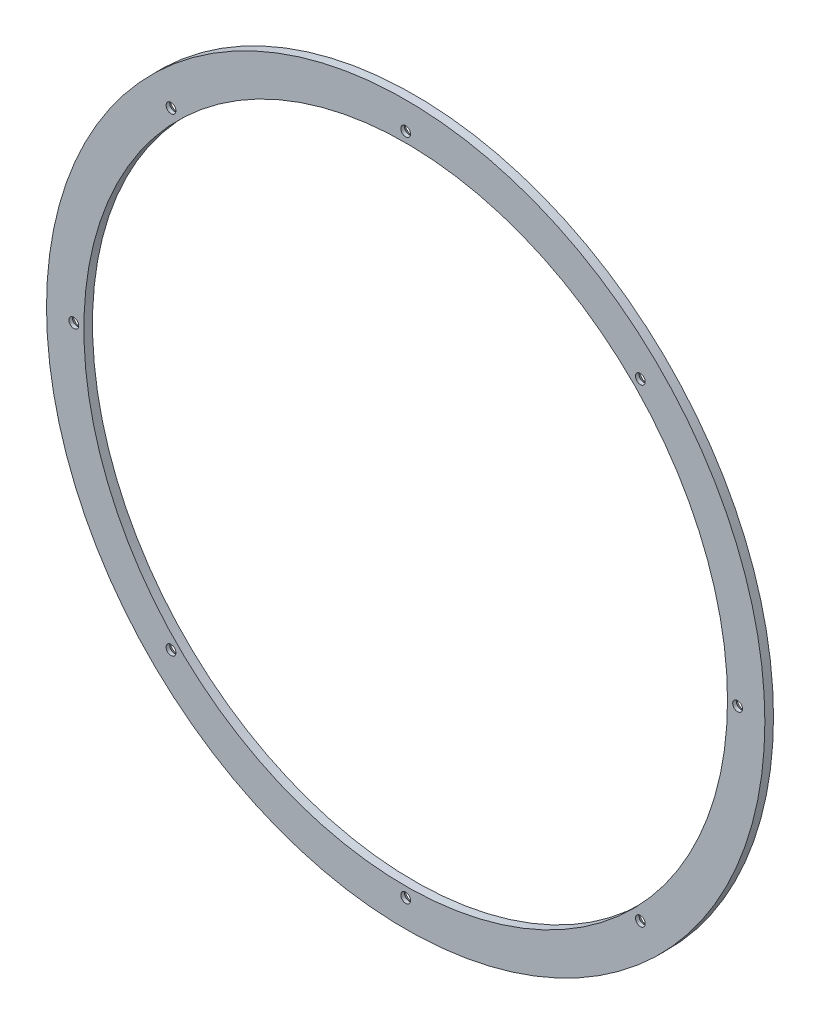
ISO-10303-21;
HEADER;
FILE_DESCRIPTION(('STEP AP214'),'2;1');
FILE_NAME('part.step','',(''),(''),'','','');
FILE_SCHEMA(('AUTOMOTIVE_DESIGN { 1 0 10303 214 1 1 1 1 }'));
ENDSEC;
DATA;
#1=APPLICATION_CONTEXT('core data for automotive mechanical design processes');
#2=APPLICATION_PROTOCOL_DEFINITION('international standard','automotive_design',2000,#1);
#3=PRODUCT_CONTEXT('',#1,'mechanical');
#4=PRODUCT('Part','Part','',(#3));
#5=PRODUCT_RELATED_PRODUCT_CATEGORY('part','',(#4));
#6=PRODUCT_DEFINITION_FORMATION('','',#4);
#7=PRODUCT_DEFINITION_CONTEXT('part definition',#1,'design');
#8=PRODUCT_DEFINITION('design','',#6,#7);
#9=PRODUCT_DEFINITION_SHAPE('','',#8);
#10=(LENGTH_UNIT() NAMED_UNIT(*) SI_UNIT(.MILLI.,.METRE.));
#11=(NAMED_UNIT(*) PLANE_ANGLE_UNIT() SI_UNIT($,.RADIAN.));
#12=(NAMED_UNIT(*) SI_UNIT($,.STERADIAN.) SOLID_ANGLE_UNIT());
#13=UNCERTAINTY_MEASURE_WITH_UNIT(LENGTH_MEASURE(1.E-05),#10,'distance_accuracy_value','');
#14=(GEOMETRIC_REPRESENTATION_CONTEXT(3) GLOBAL_UNCERTAINTY_ASSIGNED_CONTEXT((#13)) GLOBAL_UNIT_ASSIGNED_CONTEXT((#10,
#11,#12)) REPRESENTATION_CONTEXT('',''));
#15=CARTESIAN_POINT('',(0.,0.,0.));
#16=DIRECTION('',(0.,0.,1.));
#17=DIRECTION('',(1.,0.,0.));
#18=AXIS2_PLACEMENT_3D('',#15,#16,#17);
#19=CARTESIAN_POINT('',(0.,0.,3.));
#20=DIRECTION('',(0.,0.,1.));
#21=DIRECTION('',(1.,0.,0.));
#22=AXIS2_PLACEMENT_3D('',#19,#20,#21);
#23=PLANE('',#22);
#24=CARTESIAN_POINT('',(3.8091813037436E-13,-115.5,3.));
#25=DIRECTION('',(0.,0.,-1.));
#26=DIRECTION('',(0.,-1.,0.));
#27=AXIS2_PLACEMENT_3D('',#24,#25,#26);
#28=CIRCLE('',#27,1.69999999999999);
#29=CARTESIAN_POINT('',(3.86863374671228E-13,-117.2,3.));
#30=VERTEX_POINT('',#29);
#31=EDGE_CURVE('E116',#30,#30,#28,.T.);
#32=ORIENTED_EDGE('',*,*,#31,.T.);
#33=EDGE_LOOP('',(#32));
#34=FACE_BOUND('',#33,.T.);
#35=CARTESIAN_POINT('',(81.6708332270467,-81.6708332270458,3.));
#36=DIRECTION('',(0.,0.,-1.));
#37=DIRECTION('',(0.707106781186551,-0.707106781186544,0.));
#38=AXIS2_PLACEMENT_3D('',#35,#36,#37);
#39=CIRCLE('',#38,1.69999999999999);
#40=CARTESIAN_POINT('',(82.8729147550638,-82.8729147550629,3.));
#41=VERTEX_POINT('',#40);
#42=EDGE_CURVE('E109',#41,#41,#39,.T.);
#43=ORIENTED_EDGE('',*,*,#42,.T.);
#44=EDGE_LOOP('',(#43));
#45=FACE_BOUND('',#44,.T.);
#46=CARTESIAN_POINT('',(115.5,0.,3.));
#47=DIRECTION('',(0.,0.,-1.));
#48=DIRECTION('',(1.,0.,0.));
#49=AXIS2_PLACEMENT_3D('',#46,#47,#48);
#50=CIRCLE('',#49,1.69999999999999);
#51=CARTESIAN_POINT('',(117.2,0.,3.));
#52=VERTEX_POINT('',#51);
#53=EDGE_CURVE('E100',#52,#52,#50,.T.);
#54=ORIENTED_EDGE('',*,*,#53,.T.);
#55=EDGE_LOOP('',(#54));
#56=FACE_BOUND('',#55,.T.);
#57=CARTESIAN_POINT('',(81.6708332270455,81.6708332270469,3.));
#58=DIRECTION('',(0.,0.,-1.));
#59=DIRECTION('',(0.707106781186541,0.707106781186554,0.));
#60=AXIS2_PLACEMENT_3D('',#57,#58,#59);
#61=CIRCLE('',#60,1.69999999999999);
#62=CARTESIAN_POINT('',(82.8729147550626,82.8729147550641,3.));
#63=VERTEX_POINT('',#62);
#64=EDGE_CURVE('E87',#63,#63,#61,.T.);
#65=ORIENTED_EDGE('',*,*,#64,.T.);
#66=EDGE_LOOP('',(#65));
#67=FACE_BOUND('',#66,.T.);
#68=CARTESIAN_POINT('',(-1.22890525533212E-12,115.5,3.));
#69=DIRECTION('',(0.,0.,-1.));
#70=DIRECTION('',(0.,1.,0.));
#71=AXIS2_PLACEMENT_3D('',#68,#69,#70);
#72=CIRCLE('',#71,1.69999999999999);
#73=CARTESIAN_POINT('',(-1.24674098822272E-12,117.2,3.));
#74=VERTEX_POINT('',#73);
#75=EDGE_CURVE('E133',#74,#74,#72,.T.);
#76=ORIENTED_EDGE('',*,*,#75,.T.);
#77=EDGE_LOOP('',(#76));
#78=FACE_BOUND('',#77,.T.);
#79=CARTESIAN_POINT('',(-81.6708332270473,81.6708332270452,3.));
#80=DIRECTION('',(0.,0.,-1.));
#81=DIRECTION('',(-0.707106781186556,0.707106781186539,0.));
#82=AXIS2_PLACEMENT_3D('',#79,#80,#81);
#83=CIRCLE('',#82,1.69999999999999);
#84=CARTESIAN_POINT('',(-82.8729147550644,82.8729147550623,3.));
#85=VERTEX_POINT('',#84);
#86=EDGE_CURVE('E125',#85,#85,#83,.T.);
#87=ORIENTED_EDGE('',*,*,#86,.T.);
#88=EDGE_LOOP('',(#87));
#89=FACE_BOUND('',#88,.T.);
#90=CARTESIAN_POINT('',(-81.6708332270461,-81.6708332270464,3.));
#91=DIRECTION('',(0.,0.,-1.));
#92=DIRECTION('',(-0.707106781186546,-0.707106781186549,0.));
#93=AXIS2_PLACEMENT_3D('',#90,#91,#92);
#94=CIRCLE('',#93,1.69999999999999);
#95=CARTESIAN_POINT('',(-82.8729147550632,-82.8729147550635,3.));
#96=VERTEX_POINT('',#95);
#97=EDGE_CURVE('E75',#96,#96,#94,.T.);
#98=ORIENTED_EDGE('',*,*,#97,.T.);
#99=EDGE_LOOP('',(#98));
#100=FACE_BOUND('',#99,.T.);
#101=CARTESIAN_POINT('',(-115.5,0.,3.));
#102=DIRECTION('',(0.,0.,-1.));
#103=DIRECTION('',(-1.,0.,0.));
#104=AXIS2_PLACEMENT_3D('',#101,#102,#103);
#105=CIRCLE('',#104,1.69999999999999);
#106=CARTESIAN_POINT('',(-117.2,0.,3.));
#107=VERTEX_POINT('',#106);
#108=EDGE_CURVE('E57',#107,#107,#105,.T.);
#109=ORIENTED_EDGE('',*,*,#108,.T.);
#110=EDGE_LOOP('',(#109));
#111=FACE_BOUND('',#110,.T.);
#112=CARTESIAN_POINT('',(0.,0.,3.));
#113=DIRECTION('',(0.,0.,1.));
#114=DIRECTION('',(1.,0.,0.));
#115=AXIS2_PLACEMENT_3D('',#112,#113,#114);
#116=CIRCLE('',#115,125.);
#117=CARTESIAN_POINT('',(125.,0.,3.));
#118=VERTEX_POINT('',#117);
#119=EDGE_CURVE('E10',#118,#118,#116,.T.);
#120=ORIENTED_EDGE('',*,*,#119,.T.);
#121=EDGE_LOOP('',(#120));
#122=FACE_BOUND('',#121,.T.);
#123=CARTESIAN_POINT('',(0.,0.,3.));
#124=DIRECTION('',(0.,0.,1.));
#125=DIRECTION('',(1.,0.,0.));
#126=AXIS2_PLACEMENT_3D('',#123,#124,#125);
#127=CIRCLE('',#126,112.);
#128=CARTESIAN_POINT('',(112.,0.,3.));
#129=VERTEX_POINT('',#128);
#130=EDGE_CURVE('E52',#129,#129,#127,.T.);
#131=ORIENTED_EDGE('',*,*,#130,.F.);
#132=EDGE_LOOP('',(#131));
#133=FACE_BOUND('',#132,.T.);
#134=ADVANCED_FACE('F38',(#34,#45,#56,#67,#78,#89,#100,#111,#122,#133),#23,.T.);
#135=CARTESIAN_POINT('',(0.,0.,0.));
#136=DIRECTION('',(0.,0.,1.));
#137=DIRECTION('',(1.,0.,0.));
#138=AXIS2_PLACEMENT_3D('',#135,#136,#137);
#139=PLANE('',#138);
#140=CARTESIAN_POINT('',(3.8091813037436E-13,-115.5,0.));
#141=DIRECTION('',(0.,0.,-1.));
#142=DIRECTION('',(0.,-1.,0.));
#143=AXIS2_PLACEMENT_3D('',#140,#141,#142);
#144=CIRCLE('',#143,3.44999999999999);
#145=CARTESIAN_POINT('',(3.92983479094474E-13,-118.95,0.));
#146=VERTEX_POINT('',#145);
#147=EDGE_CURVE('E108',#146,#146,#144,.T.);
#148=ORIENTED_EDGE('',*,*,#147,.F.);
#149=EDGE_LOOP('',(#148));
#150=FACE_BOUND('',#149,.T.);
#151=CARTESIAN_POINT('',(81.6708332270467,-81.6708332270458,0.));
#152=DIRECTION('',(0.,0.,-1.));
#153=DIRECTION('',(0.707106781186551,-0.707106781186544,0.));
#154=AXIS2_PLACEMENT_3D('',#151,#152,#153);
#155=CIRCLE('',#154,3.44999999999999);
#156=CARTESIAN_POINT('',(84.1103516221403,-84.1103516221394,0.));
#157=VERTEX_POINT('',#156);
#158=EDGE_CURVE('E99',#157,#157,#155,.T.);
#159=ORIENTED_EDGE('',*,*,#158,.F.);
#160=EDGE_LOOP('',(#159));
#161=FACE_BOUND('',#160,.T.);
#162=CARTESIAN_POINT('',(115.5,0.,0.));
#163=DIRECTION('',(0.,0.,-1.));
#164=DIRECTION('',(1.,0.,0.));
#165=AXIS2_PLACEMENT_3D('',#162,#163,#164);
#166=CIRCLE('',#165,3.44999999999999);
#167=CARTESIAN_POINT('',(118.95,0.,0.));
#168=VERTEX_POINT('',#167);
#169=EDGE_CURVE('E86',#168,#168,#166,.T.);
#170=ORIENTED_EDGE('',*,*,#169,.F.);
#171=EDGE_LOOP('',(#170));
#172=FACE_BOUND('',#171,.T.);
#173=CARTESIAN_POINT('',(81.6708332270455,81.6708332270469,0.));
#174=DIRECTION('',(0.,0.,-1.));
#175=DIRECTION('',(0.707106781186541,0.707106781186554,0.));
#176=AXIS2_PLACEMENT_3D('',#173,#174,#175);
#177=CIRCLE('',#176,3.44999999999999);
#178=CARTESIAN_POINT('',(84.1103516221391,84.1103516221405,0.));
#179=VERTEX_POINT('',#178);
#180=EDGE_CURVE('E91',#179,#179,#177,.T.);
#181=ORIENTED_EDGE('',*,*,#180,.F.);
#182=EDGE_LOOP('',(#181));
#183=FACE_BOUND('',#182,.T.);
#184=CARTESIAN_POINT('',(-1.22890525533212E-12,115.5,0.));
#185=DIRECTION('',(0.,0.,-1.));
#186=DIRECTION('',(0.,1.,0.));
#187=AXIS2_PLACEMENT_3D('',#184,#185,#186);
#188=CIRCLE('',#187,3.44999999999999);
#189=CARTESIAN_POINT('',(-1.26510130149246E-12,118.95,0.));
#190=VERTEX_POINT('',#189);
#191=EDGE_CURVE('E124',#190,#190,#188,.T.);
#192=ORIENTED_EDGE('',*,*,#191,.F.);
#193=EDGE_LOOP('',(#192));
#194=FACE_BOUND('',#193,.T.);
#195=CARTESIAN_POINT('',(-81.6708332270473,81.6708332270452,0.));
#196=DIRECTION('',(0.,0.,-1.));
#197=DIRECTION('',(-0.707106781186556,0.707106781186539,0.));
#198=AXIS2_PLACEMENT_3D('',#195,#196,#197);
#199=CIRCLE('',#198,3.44999999999999);
#200=CARTESIAN_POINT('',(-84.1103516221409,84.1103516221388,0.));
#201=VERTEX_POINT('',#200);
#202=EDGE_CURVE('E128',#201,#201,#199,.T.);
#203=ORIENTED_EDGE('',*,*,#202,.F.);
#204=EDGE_LOOP('',(#203));
#205=FACE_BOUND('',#204,.T.);
#206=CARTESIAN_POINT('',(-81.6708332270461,-81.6708332270464,0.));
#207=DIRECTION('',(0.,0.,-1.));
#208=DIRECTION('',(-0.707106781186546,-0.707106781186549,0.));
#209=AXIS2_PLACEMENT_3D('',#206,#207,#208);
#210=CIRCLE('',#209,3.44999999999999);
#211=CARTESIAN_POINT('',(-84.1103516221397,-84.11035162214,0.));
#212=VERTEX_POINT('',#211);
#213=EDGE_CURVE('E78',#212,#212,#210,.T.);
#214=ORIENTED_EDGE('',*,*,#213,.F.);
#215=EDGE_LOOP('',(#214));
#216=FACE_BOUND('',#215,.T.);
#217=CARTESIAN_POINT('',(-115.5,0.,0.));
#218=DIRECTION('',(0.,0.,-1.));
#219=DIRECTION('',(-1.,0.,0.));
#220=AXIS2_PLACEMENT_3D('',#217,#218,#219);
#221=CIRCLE('',#220,3.44999999999999);
#222=CARTESIAN_POINT('',(-118.95,0.,0.));
#223=VERTEX_POINT('',#222);
#224=EDGE_CURVE('E68',#223,#223,#221,.T.);
#225=ORIENTED_EDGE('',*,*,#224,.F.);
#226=EDGE_LOOP('',(#225));
#227=FACE_BOUND('',#226,.T.);
#228=CARTESIAN_POINT('',(0.,0.,0.));
#229=DIRECTION('',(0.,0.,1.));
#230=DIRECTION('',(1.,0.,0.));
#231=AXIS2_PLACEMENT_3D('',#228,#229,#230);
#232=CIRCLE('',#231,125.);
#233=CARTESIAN_POINT('',(125.,0.,0.));
#234=VERTEX_POINT('',#233);
#235=EDGE_CURVE('E42',#234,#234,#232,.T.);
#236=ORIENTED_EDGE('',*,*,#235,.F.);
#237=EDGE_LOOP('',(#236));
#238=FACE_BOUND('',#237,.T.);
#239=CARTESIAN_POINT('',(0.,0.,0.));
#240=DIRECTION('',(0.,0.,1.));
#241=DIRECTION('',(1.,0.,0.));
#242=AXIS2_PLACEMENT_3D('',#239,#240,#241);
#243=CIRCLE('',#242,112.);
#244=CARTESIAN_POINT('',(112.,0.,0.));
#245=VERTEX_POINT('',#244);
#246=EDGE_CURVE('E54',#245,#245,#243,.T.);
#247=ORIENTED_EDGE('',*,*,#246,.T.);
#248=EDGE_LOOP('',(#247));
#249=FACE_BOUND('',#248,.T.);
#250=ADVANCED_FACE('F141',(#150,#161,#172,#183,#194,#205,#216,#227,#238,#249),#139,.F.);
#251=CARTESIAN_POINT('',(0.,0.,3.));
#252=DIRECTION('',(0.,0.,-1.));
#253=DIRECTION('',(-1.,0.,0.));
#254=AXIS2_PLACEMENT_3D('',#251,#252,#253);
#255=CYLINDRICAL_SURFACE('',#254,125.);
#256=ORIENTED_EDGE('',*,*,#119,.F.);
#257=EDGE_LOOP('',(#256));
#258=FACE_BOUND('',#257,.T.);
#259=ORIENTED_EDGE('',*,*,#235,.T.);
#260=EDGE_LOOP('',(#259));
#261=FACE_BOUND('',#260,.T.);
#262=ADVANCED_FACE('F40',(#258,#261),#255,.T.);
#263=CARTESIAN_POINT('',(0.,0.,3.));
#264=DIRECTION('',(0.,0.,-1.));
#265=DIRECTION('',(-1.,0.,0.));
#266=AXIS2_PLACEMENT_3D('',#263,#264,#265);
#267=CYLINDRICAL_SURFACE('',#266,112.);
#268=ORIENTED_EDGE('',*,*,#130,.T.);
#269=EDGE_LOOP('',(#268));
#270=FACE_BOUND('',#269,.T.);
#271=ORIENTED_EDGE('',*,*,#246,.F.);
#272=EDGE_LOOP('',(#271));
#273=FACE_BOUND('',#272,.T.);
#274=ADVANCED_FACE('F155',(#270,#273),#267,.F.);
#275=CARTESIAN_POINT('',(-115.5,0.,0.));
#276=DIRECTION('',(0.,0.,-1.));
#277=DIRECTION('',(-1.,0.,0.));
#278=AXIS2_PLACEMENT_3D('',#275,#276,#277);
#279=CYLINDRICAL_SURFACE('',#278,1.69999999999999);
#280=ORIENTED_EDGE('',*,*,#108,.F.);
#281=EDGE_LOOP('',(#280));
#282=FACE_BOUND('',#281,.T.);
#283=CARTESIAN_POINT('',(-115.5,0.,1.75000000000001));
#284=DIRECTION('',(0.,0.,-1.));
#285=DIRECTION('',(-1.,0.,0.));
#286=AXIS2_PLACEMENT_3D('',#283,#284,#285);
#287=CIRCLE('',#286,1.69999999999999);
#288=CARTESIAN_POINT('',(-117.2,0.,1.75000000000001));
#289=VERTEX_POINT('',#288);
#290=EDGE_CURVE('E64',#289,#289,#287,.T.);
#291=ORIENTED_EDGE('',*,*,#290,.T.);
#292=EDGE_LOOP('',(#291));
#293=FACE_BOUND('',#292,.T.);
#294=ADVANCED_FACE('F157',(#282,#293),#279,.F.);
#295=CARTESIAN_POINT('',(-115.5,0.,0.));
#296=DIRECTION('',(0.,0.,-1.));
#297=DIRECTION('',(-1.,0.,0.));
#298=AXIS2_PLACEMENT_3D('',#295,#296,#297);
#299=CONICAL_SURFACE('',#298,3.44999999999999,0.785398163397448);
#300=ORIENTED_EDGE('',*,*,#290,.F.);
#301=EDGE_LOOP('',(#300));
#302=FACE_BOUND('',#301,.T.);
#303=ORIENTED_EDGE('',*,*,#224,.T.);
#304=EDGE_LOOP('',(#303));
#305=FACE_BOUND('',#304,.T.);
#306=ADVANCED_FACE('F164',(#302,#305),#299,.F.);
#307=CARTESIAN_POINT('',(-81.6708332270461,-81.6708332270464,0.));
#308=DIRECTION('',(0.,0.,-1.));
#309=DIRECTION('',(-0.707106781186546,-0.707106781186549,0.));
#310=AXIS2_PLACEMENT_3D('',#307,#308,#309);
#311=CYLINDRICAL_SURFACE('',#310,1.69999999999999);
#312=ORIENTED_EDGE('',*,*,#97,.F.);
#313=EDGE_LOOP('',(#312));
#314=FACE_BOUND('',#313,.T.);
#315=CARTESIAN_POINT('',(-81.6708332270461,-81.6708332270464,1.75));
#316=DIRECTION('',(0.,0.,-1.));
#317=DIRECTION('',(-0.707106781186546,-0.707106781186549,0.));
#318=AXIS2_PLACEMENT_3D('',#315,#316,#317);
#319=CIRCLE('',#318,1.69999999999999);
#320=CARTESIAN_POINT('',(-82.8729147550632,-82.8729147550635,1.75));
#321=VERTEX_POINT('',#320);
#322=EDGE_CURVE('E72',#321,#321,#319,.T.);
#323=ORIENTED_EDGE('',*,*,#322,.T.);
#324=EDGE_LOOP('',(#323));
#325=FACE_BOUND('',#324,.T.);
#326=ADVANCED_FACE('F195',(#314,#325),#311,.F.);
#327=CARTESIAN_POINT('',(-81.6708332270461,-81.6708332270464,0.));
#328=DIRECTION('',(0.,0.,-1.));
#329=DIRECTION('',(-0.707106781186546,-0.707106781186549,0.));
#330=AXIS2_PLACEMENT_3D('',#327,#328,#329);
#331=CONICAL_SURFACE('',#330,3.44999999999999,0.785398163397448);
#332=ORIENTED_EDGE('',*,*,#322,.F.);
#333=EDGE_LOOP('',(#332));
#334=FACE_BOUND('',#333,.T.);
#335=ORIENTED_EDGE('',*,*,#213,.T.);
#336=EDGE_LOOP('',(#335));
#337=FACE_BOUND('',#336,.T.);
#338=ADVANCED_FACE('F200',(#334,#337),#331,.F.);
#339=CARTESIAN_POINT('',(-81.6708332270473,81.6708332270452,0.));
#340=DIRECTION('',(0.,0.,-1.));
#341=DIRECTION('',(-0.707106781186556,0.707106781186539,0.));
#342=AXIS2_PLACEMENT_3D('',#339,#340,#341);
#343=CYLINDRICAL_SURFACE('',#342,1.69999999999999);
#344=ORIENTED_EDGE('',*,*,#86,.F.);
#345=EDGE_LOOP('',(#344));
#346=FACE_BOUND('',#345,.T.);
#347=CARTESIAN_POINT('',(-81.6708332270473,81.6708332270452,1.75));
#348=DIRECTION('',(0.,0.,-1.));
#349=DIRECTION('',(-0.707106781186556,0.707106781186539,0.));
#350=AXIS2_PLACEMENT_3D('',#347,#348,#349);
#351=CIRCLE('',#350,1.69999999999999);
#352=CARTESIAN_POINT('',(-82.8729147550644,82.8729147550623,1.75));
#353=VERTEX_POINT('',#352);
#354=EDGE_CURVE('E121',#353,#353,#351,.T.);
#355=ORIENTED_EDGE('',*,*,#354,.T.);
#356=EDGE_LOOP('',(#355));
#357=FACE_BOUND('',#356,.T.);
#358=ADVANCED_FACE('F206',(#346,#357),#343,.F.);
#359=CARTESIAN_POINT('',(-81.6708332270473,81.6708332270452,0.));
#360=DIRECTION('',(0.,0.,-1.));
#361=DIRECTION('',(-0.707106781186556,0.707106781186539,0.));
#362=AXIS2_PLACEMENT_3D('',#359,#360,#361);
#363=CONICAL_SURFACE('',#362,3.44999999999999,0.785398163397448);
#364=ORIENTED_EDGE('',*,*,#354,.F.);
#365=EDGE_LOOP('',(#364));
#366=FACE_BOUND('',#365,.T.);
#367=ORIENTED_EDGE('',*,*,#202,.T.);
#368=EDGE_LOOP('',(#367));
#369=FACE_BOUND('',#368,.T.);
#370=ADVANCED_FACE('F242',(#366,#369),#363,.F.);
#371=CARTESIAN_POINT('',(-1.22890525533212E-12,115.5,0.));
#372=DIRECTION('',(0.,0.,-1.));
#373=DIRECTION('',(0.,1.,0.));
#374=AXIS2_PLACEMENT_3D('',#371,#372,#373);
#375=CYLINDRICAL_SURFACE('',#374,1.69999999999999);
#376=ORIENTED_EDGE('',*,*,#75,.F.);
#377=EDGE_LOOP('',(#376));
#378=FACE_BOUND('',#377,.T.);
#379=CARTESIAN_POINT('',(-1.22890525533212E-12,115.5,1.75));
#380=DIRECTION('',(0.,0.,-1.));
#381=DIRECTION('',(0.,1.,0.));
#382=AXIS2_PLACEMENT_3D('',#379,#380,#381);
#383=CIRCLE('',#382,1.69999999999999);
#384=CARTESIAN_POINT('',(-1.24674098822272E-12,117.2,1.75));
#385=VERTEX_POINT('',#384);
#386=EDGE_CURVE('E95',#385,#385,#383,.T.);
#387=ORIENTED_EDGE('',*,*,#386,.T.);
#388=EDGE_LOOP('',(#387));
#389=FACE_BOUND('',#388,.T.);
#390=ADVANCED_FACE('F246',(#378,#389),#375,.F.);
#391=CARTESIAN_POINT('',(-1.22890525533212E-12,115.5,0.));
#392=DIRECTION('',(0.,0.,-1.));
#393=DIRECTION('',(0.,1.,0.));
#394=AXIS2_PLACEMENT_3D('',#391,#392,#393);
#395=CONICAL_SURFACE('',#394,3.44999999999999,0.785398163397448);
#396=ORIENTED_EDGE('',*,*,#386,.F.);
#397=EDGE_LOOP('',(#396));
#398=FACE_BOUND('',#397,.T.);
#399=ORIENTED_EDGE('',*,*,#191,.T.);
#400=EDGE_LOOP('',(#399));
#401=FACE_BOUND('',#400,.T.);
#402=ADVANCED_FACE('F139',(#398,#401),#395,.F.);
#403=CARTESIAN_POINT('',(81.6708332270455,81.6708332270469,0.));
#404=DIRECTION('',(0.,0.,-1.));
#405=DIRECTION('',(0.707106781186541,0.707106781186554,0.));
#406=AXIS2_PLACEMENT_3D('',#403,#404,#405);
#407=CYLINDRICAL_SURFACE('',#406,1.69999999999999);
#408=ORIENTED_EDGE('',*,*,#64,.F.);
#409=EDGE_LOOP('',(#408));
#410=FACE_BOUND('',#409,.T.);
#411=CARTESIAN_POINT('',(81.6708332270455,81.6708332270469,1.75));
#412=DIRECTION('',(0.,0.,-1.));
#413=DIRECTION('',(0.707106781186541,0.707106781186554,0.));
#414=AXIS2_PLACEMENT_3D('',#411,#412,#413);
#415=CIRCLE('',#414,1.69999999999999);
#416=CARTESIAN_POINT('',(82.8729147550626,82.8729147550641,1.75));
#417=VERTEX_POINT('',#416);
#418=EDGE_CURVE('E82',#417,#417,#415,.T.);
#419=ORIENTED_EDGE('',*,*,#418,.T.);
#420=EDGE_LOOP('',(#419));
#421=FACE_BOUND('',#420,.T.);
#422=ADVANCED_FACE('F208',(#410,#421),#407,.F.);
#423=CARTESIAN_POINT('',(81.6708332270455,81.6708332270469,0.));
#424=DIRECTION('',(0.,0.,-1.));
#425=DIRECTION('',(0.707106781186541,0.707106781186554,0.));
#426=AXIS2_PLACEMENT_3D('',#423,#424,#425);
#427=CONICAL_SURFACE('',#426,3.44999999999999,0.785398163397448);
#428=ORIENTED_EDGE('',*,*,#418,.F.);
#429=EDGE_LOOP('',(#428));
#430=FACE_BOUND('',#429,.T.);
#431=ORIENTED_EDGE('',*,*,#180,.T.);
#432=EDGE_LOOP('',(#431));
#433=FACE_BOUND('',#432,.T.);
#434=ADVANCED_FACE('F211',(#430,#433),#427,.F.);
#435=CARTESIAN_POINT('',(115.5,0.,0.));
#436=DIRECTION('',(0.,0.,-1.));
#437=DIRECTION('',(1.,0.,0.));
#438=AXIS2_PLACEMENT_3D('',#435,#436,#437);
#439=CYLINDRICAL_SURFACE('',#438,1.69999999999999);
#440=ORIENTED_EDGE('',*,*,#53,.F.);
#441=EDGE_LOOP('',(#440));
#442=FACE_BOUND('',#441,.T.);
#443=CARTESIAN_POINT('',(115.5,0.,1.75));
#444=DIRECTION('',(0.,0.,-1.));
#445=DIRECTION('',(1.,0.,0.));
#446=AXIS2_PLACEMENT_3D('',#443,#444,#445);
#447=CIRCLE('',#446,1.69999999999999);
#448=CARTESIAN_POINT('',(117.2,0.,1.75));
#449=VERTEX_POINT('',#448);
#450=EDGE_CURVE('E96',#449,#449,#447,.T.);
#451=ORIENTED_EDGE('',*,*,#450,.T.);
#452=EDGE_LOOP('',(#451));
#453=FACE_BOUND('',#452,.T.);
#454=ADVANCED_FACE('F215',(#442,#453),#439,.F.);
#455=CARTESIAN_POINT('',(115.5,0.,0.));
#456=DIRECTION('',(0.,0.,-1.));
#457=DIRECTION('',(1.,0.,0.));
#458=AXIS2_PLACEMENT_3D('',#455,#456,#457);
#459=CONICAL_SURFACE('',#458,3.44999999999999,0.785398163397448);
#460=ORIENTED_EDGE('',*,*,#450,.F.);
#461=EDGE_LOOP('',(#460));
#462=FACE_BOUND('',#461,.T.);
#463=ORIENTED_EDGE('',*,*,#169,.T.);
#464=EDGE_LOOP('',(#463));
#465=FACE_BOUND('',#464,.T.);
#466=ADVANCED_FACE('F219',(#462,#465),#459,.F.);
#467=CARTESIAN_POINT('',(81.6708332270467,-81.6708332270458,0.));
#468=DIRECTION('',(0.,0.,-1.));
#469=DIRECTION('',(0.707106781186551,-0.707106781186544,0.));
#470=AXIS2_PLACEMENT_3D('',#467,#468,#469);
#471=CYLINDRICAL_SURFACE('',#470,1.69999999999999);
#472=ORIENTED_EDGE('',*,*,#42,.F.);
#473=EDGE_LOOP('',(#472));
#474=FACE_BOUND('',#473,.T.);
#475=CARTESIAN_POINT('',(81.6708332270467,-81.6708332270458,1.75));
#476=DIRECTION('',(0.,0.,-1.));
#477=DIRECTION('',(0.707106781186551,-0.707106781186544,0.));
#478=AXIS2_PLACEMENT_3D('',#475,#476,#477);
#479=CIRCLE('',#478,1.69999999999999);
#480=CARTESIAN_POINT('',(82.8729147550638,-82.8729147550629,1.75));
#481=VERTEX_POINT('',#480);
#482=EDGE_CURVE('E105',#481,#481,#479,.T.);
#483=ORIENTED_EDGE('',*,*,#482,.T.);
#484=EDGE_LOOP('',(#483));
#485=FACE_BOUND('',#484,.T.);
#486=ADVANCED_FACE('F223',(#474,#485),#471,.F.);
#487=CARTESIAN_POINT('',(81.6708332270467,-81.6708332270458,0.));
#488=DIRECTION('',(0.,0.,-1.));
#489=DIRECTION('',(0.707106781186551,-0.707106781186544,0.));
#490=AXIS2_PLACEMENT_3D('',#487,#488,#489);
#491=CONICAL_SURFACE('',#490,3.44999999999999,0.785398163397448);
#492=ORIENTED_EDGE('',*,*,#482,.F.);
#493=EDGE_LOOP('',(#492));
#494=FACE_BOUND('',#493,.T.);
#495=ORIENTED_EDGE('',*,*,#158,.T.);
#496=EDGE_LOOP('',(#495));
#497=FACE_BOUND('',#496,.T.);
#498=ADVANCED_FACE('F227',(#494,#497),#491,.F.);
#499=CARTESIAN_POINT('',(3.8091813037436E-13,-115.5,0.));
#500=DIRECTION('',(0.,0.,-1.));
#501=DIRECTION('',(0.,-1.,0.));
#502=AXIS2_PLACEMENT_3D('',#499,#500,#501);
#503=CYLINDRICAL_SURFACE('',#502,1.69999999999999);
#504=ORIENTED_EDGE('',*,*,#31,.F.);
#505=EDGE_LOOP('',(#504));
#506=FACE_BOUND('',#505,.T.);
#507=CARTESIAN_POINT('',(3.8091813037436E-13,-115.5,1.75));
#508=DIRECTION('',(0.,0.,-1.));
#509=DIRECTION('',(0.,-1.,0.));
#510=AXIS2_PLACEMENT_3D('',#507,#508,#509);
#511=CIRCLE('',#510,1.69999999999999);
#512=CARTESIAN_POINT('',(3.86863374671228E-13,-117.2,1.75));
#513=VERTEX_POINT('',#512);
#514=EDGE_CURVE('E81',#513,#513,#511,.T.);
#515=ORIENTED_EDGE('',*,*,#514,.T.);
#516=EDGE_LOOP('',(#515));
#517=FACE_BOUND('',#516,.T.);
#518=ADVANCED_FACE('F231',(#506,#517),#503,.F.);
#519=CARTESIAN_POINT('',(3.8091813037436E-13,-115.5,0.));
#520=DIRECTION('',(0.,0.,-1.));
#521=DIRECTION('',(0.,-1.,0.));
#522=AXIS2_PLACEMENT_3D('',#519,#520,#521);
#523=CONICAL_SURFACE('',#522,3.44999999999999,0.785398163397448);
#524=ORIENTED_EDGE('',*,*,#514,.F.);
#525=EDGE_LOOP('',(#524));
#526=FACE_BOUND('',#525,.T.);
#527=ORIENTED_EDGE('',*,*,#147,.T.);
#528=EDGE_LOOP('',(#527));
#529=FACE_BOUND('',#528,.T.);
#530=ADVANCED_FACE('F235',(#526,#529),#523,.F.);
#531=CLOSED_SHELL('',(#134,#250,#262,#274,#294,#306,#326,#338,#358,#370,#390,#402,#422,#434,
#454,#466,#486,#498,#518,#530));
#532=MANIFOLD_SOLID_BREP('B2',#531);
#533=ADVANCED_BREP_SHAPE_REPRESENTATION('',(#18,#532),#14);
#534=SHAPE_DEFINITION_REPRESENTATION(#9,#533);
ENDSEC;
END-ISO-10303-21;
